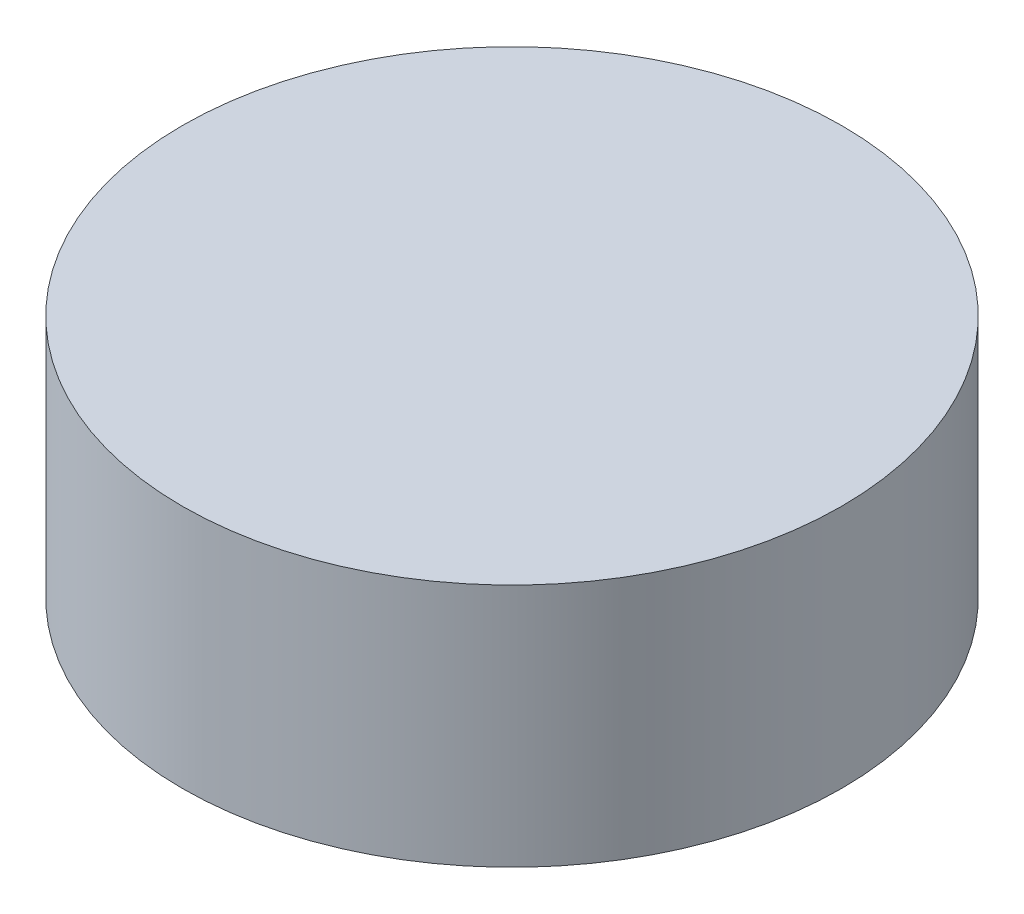
ISO-10303-21;
HEADER;
FILE_DESCRIPTION(('STEP AP214'),'2;1');
FILE_NAME('part.step','',(''),(''),'','','');
FILE_SCHEMA(('AUTOMOTIVE_DESIGN { 1 0 10303 214 1 1 1 1 }'));
ENDSEC;
DATA;
#1=APPLICATION_CONTEXT('core data for automotive mechanical design processes');
#2=APPLICATION_PROTOCOL_DEFINITION('international standard','automotive_design',2000,#1);
#3=PRODUCT_CONTEXT('',#1,'mechanical');
#4=PRODUCT('Part','Part','',(#3));
#5=PRODUCT_RELATED_PRODUCT_CATEGORY('part','',(#4));
#6=PRODUCT_DEFINITION_FORMATION('','',#4);
#7=PRODUCT_DEFINITION_CONTEXT('part definition',#1,'design');
#8=PRODUCT_DEFINITION('design','',#6,#7);
#9=PRODUCT_DEFINITION_SHAPE('','',#8);
#10=(LENGTH_UNIT() NAMED_UNIT(*) SI_UNIT(.MILLI.,.METRE.));
#11=(NAMED_UNIT(*) PLANE_ANGLE_UNIT() SI_UNIT($,.RADIAN.));
#12=(NAMED_UNIT(*) SI_UNIT($,.STERADIAN.) SOLID_ANGLE_UNIT());
#13=UNCERTAINTY_MEASURE_WITH_UNIT(LENGTH_MEASURE(1.E-05),#10,'distance_accuracy_value','');
#14=(GEOMETRIC_REPRESENTATION_CONTEXT(3) GLOBAL_UNCERTAINTY_ASSIGNED_CONTEXT((#13)) GLOBAL_UNIT_ASSIGNED_CONTEXT((#10,
#11,#12)) REPRESENTATION_CONTEXT('',''));
#15=CARTESIAN_POINT('',(0.,0.,0.));
#16=DIRECTION('',(0.,0.,1.));
#17=DIRECTION('',(1.,0.,0.));
#18=AXIS2_PLACEMENT_3D('',#15,#16,#17);
#19=CARTESIAN_POINT('',(0.,10.,0.));
#20=DIRECTION('',(0.,-1.,0.));
#21=DIRECTION('',(0.,0.,-1.));
#22=AXIS2_PLACEMENT_3D('',#19,#20,#21);
#23=CYLINDRICAL_SURFACE('',#22,13.49);
#24=CARTESIAN_POINT('',(0.,10.,0.));
#25=DIRECTION('',(0.,1.,0.));
#26=DIRECTION('',(0.,0.,1.));
#27=AXIS2_PLACEMENT_3D('',#24,#25,#26);
#28=CIRCLE('',#27,13.49);
#29=CARTESIAN_POINT('',(0.,10.,13.49));
#30=VERTEX_POINT('',#29);
#31=EDGE_CURVE('E10',#30,#30,#28,.T.);
#32=ORIENTED_EDGE('',*,*,#31,.F.);
#33=EDGE_LOOP('',(#32));
#34=FACE_BOUND('',#33,.T.);
#35=CARTESIAN_POINT('',(0.,0.,0.));
#36=DIRECTION('',(0.,1.,0.));
#37=DIRECTION('',(0.,0.,1.));
#38=AXIS2_PLACEMENT_3D('',#35,#36,#37);
#39=CIRCLE('',#38,13.49);
#40=CARTESIAN_POINT('',(0.,0.,13.49));
#41=VERTEX_POINT('',#40);
#42=EDGE_CURVE('E34',#41,#41,#39,.T.);
#43=ORIENTED_EDGE('',*,*,#42,.T.);
#44=EDGE_LOOP('',(#43));
#45=FACE_BOUND('',#44,.T.);
#46=ADVANCED_FACE('F31',(#34,#45),#23,.T.);
#47=CARTESIAN_POINT('',(0.,10.,0.));
#48=DIRECTION('',(0.,1.,0.));
#49=DIRECTION('',(0.,0.,1.));
#50=AXIS2_PLACEMENT_3D('',#47,#48,#49);
#51=PLANE('',#50);
#52=ORIENTED_EDGE('',*,*,#31,.T.);
#53=EDGE_LOOP('',(#52));
#54=FACE_BOUND('',#53,.T.);
#55=ADVANCED_FACE('F46',(#54),#51,.T.);
#56=CARTESIAN_POINT('',(0.,0.,0.));
#57=DIRECTION('',(0.,1.,0.));
#58=DIRECTION('',(0.,0.,1.));
#59=AXIS2_PLACEMENT_3D('',#56,#57,#58);
#60=PLANE('',#59);
#61=ORIENTED_EDGE('',*,*,#42,.F.);
#62=EDGE_LOOP('',(#61));
#63=FACE_BOUND('',#62,.T.);
#64=ADVANCED_FACE('F44',(#63),#60,.F.);
#65=CLOSED_SHELL('',(#46,#55,#64));
#66=MANIFOLD_SOLID_BREP('B2',#65);
#67=ADVANCED_BREP_SHAPE_REPRESENTATION('',(#18,#66),#14);
#68=SHAPE_DEFINITION_REPRESENTATION(#9,#67);
ENDSEC;
END-ISO-10303-21;
